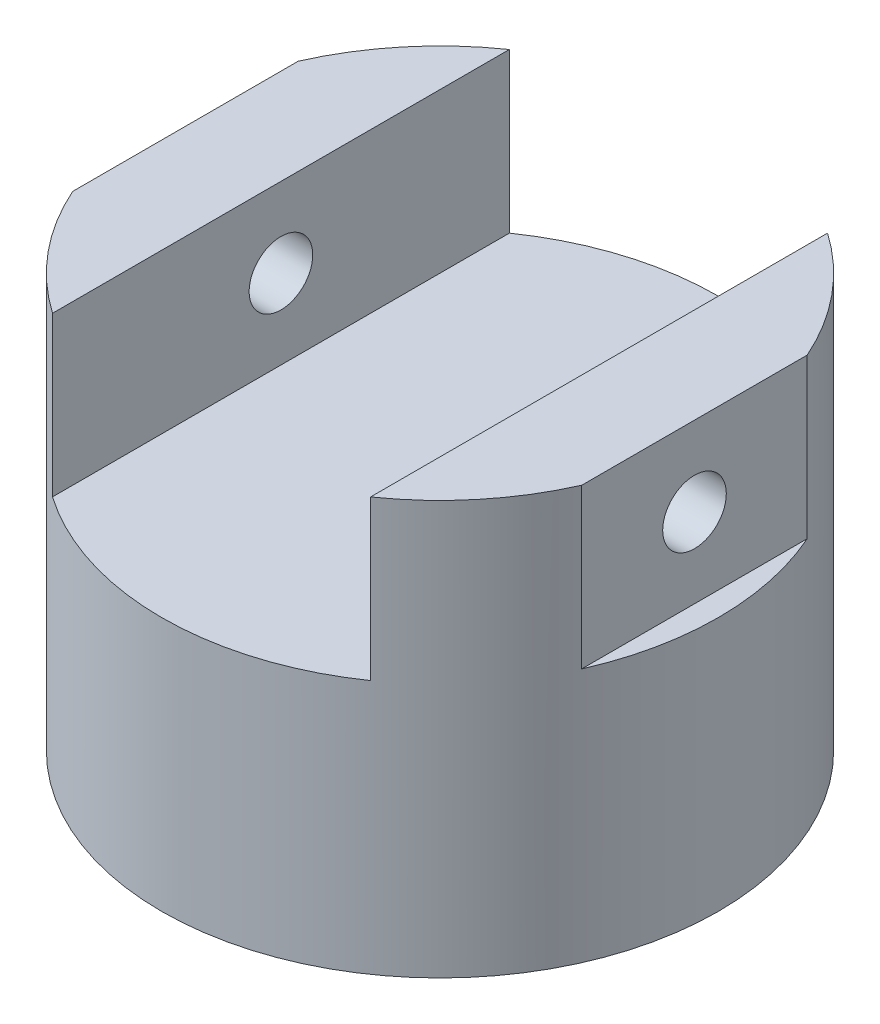
ISO-10303-21;
HEADER;
FILE_DESCRIPTION(('STEP AP214'),'2;1');
FILE_NAME('part.step','',(''),(''),'','','');
FILE_SCHEMA(('AUTOMOTIVE_DESIGN { 1 0 10303 214 1 1 1 1 }'));
ENDSEC;
DATA;
#1=APPLICATION_CONTEXT('core data for automotive mechanical design processes');
#2=APPLICATION_PROTOCOL_DEFINITION('international standard','automotive_design',2000,#1);
#3=PRODUCT_CONTEXT('',#1,'mechanical');
#4=PRODUCT('Part','Part','',(#3));
#5=PRODUCT_RELATED_PRODUCT_CATEGORY('part','',(#4));
#6=PRODUCT_DEFINITION_FORMATION('','',#4);
#7=PRODUCT_DEFINITION_CONTEXT('part definition',#1,'design');
#8=PRODUCT_DEFINITION('design','',#6,#7);
#9=PRODUCT_DEFINITION_SHAPE('','',#8);
#10=(LENGTH_UNIT() NAMED_UNIT(*) SI_UNIT(.MILLI.,.METRE.));
#11=(NAMED_UNIT(*) PLANE_ANGLE_UNIT() SI_UNIT($,.RADIAN.));
#12=(NAMED_UNIT(*) SI_UNIT($,.STERADIAN.) SOLID_ANGLE_UNIT());
#13=UNCERTAINTY_MEASURE_WITH_UNIT(LENGTH_MEASURE(1.E-05),#10,'distance_accuracy_value','');
#14=(GEOMETRIC_REPRESENTATION_CONTEXT(3) GLOBAL_UNCERTAINTY_ASSIGNED_CONTEXT((#13)) GLOBAL_UNIT_ASSIGNED_CONTEXT((#10,
#11,#12)) REPRESENTATION_CONTEXT('',''));
#15=CARTESIAN_POINT('',(0.,0.,0.));
#16=DIRECTION('',(0.,0.,1.));
#17=DIRECTION('',(1.,0.,0.));
#18=AXIS2_PLACEMENT_3D('',#15,#16,#17);
#19=CARTESIAN_POINT('',(0.,260.,0.));
#20=DIRECTION('',(0.,1.,0.));
#21=DIRECTION('',(0.,0.,1.));
#22=AXIS2_PLACEMENT_3D('',#19,#20,#21);
#23=PLANE('',#22);
#24=DIRECTION('',(0.,0.,1.));
#25=VECTOR('',#24,1.);
#26=CARTESIAN_POINT('',(160.,260.,-175.));
#27=LINE('',#26,#25);
#28=CARTESIAN_POINT('',(160.,260.,-70.887234393789));
#29=VERTEX_POINT('',#28);
#30=CARTESIAN_POINT('',(160.,260.,70.887234393789));
#31=VERTEX_POINT('',#30);
#32=EDGE_CURVE('E49',#29,#31,#27,.T.);
#33=ORIENTED_EDGE('',*,*,#32,.F.);
#34=CARTESIAN_POINT('',(0.,260.,0.));
#35=DIRECTION('',(0.,-1.,0.));
#36=DIRECTION('',(0.,0.,-1.));
#37=AXIS2_PLACEMENT_3D('',#34,#35,#36);
#38=CIRCLE('',#37,175.);
#39=CARTESIAN_POINT('',(100.,260.,-143.614066163451));
#40=VERTEX_POINT('',#39);
#41=EDGE_CURVE('E146',#40,#29,#38,.T.);
#42=ORIENTED_EDGE('',*,*,#41,.F.);
#43=DIRECTION('',(0.,0.,1.));
#44=VECTOR('',#43,1.);
#45=CARTESIAN_POINT('',(100.,260.,-175.));
#46=LINE('',#45,#44);
#47=CARTESIAN_POINT('',(100.,260.,143.614066163451));
#48=VERTEX_POINT('',#47);
#49=EDGE_CURVE('E129',#40,#48,#46,.T.);
#50=ORIENTED_EDGE('',*,*,#49,.T.);
#51=EDGE_CURVE('E145',#31,#48,#38,.T.);
#52=ORIENTED_EDGE('',*,*,#51,.F.);
#53=EDGE_LOOP('',(#33,#42,#50,#52));
#54=FACE_BOUND('',#53,.T.);
#55=ADVANCED_FACE('F33',(#54),#23,.T.);
#56=DIRECTION('',(0.,0.,1.));
#57=VECTOR('',#56,1.);
#58=CARTESIAN_POINT('',(-160.,260.,-175.));
#59=LINE('',#58,#57);
#60=CARTESIAN_POINT('',(-160.,260.,-70.887234393789));
#61=VERTEX_POINT('',#60);
#62=CARTESIAN_POINT('',(-160.,260.,70.887234393789));
#63=VERTEX_POINT('',#62);
#64=EDGE_CURVE('E115',#61,#63,#59,.T.);
#65=ORIENTED_EDGE('',*,*,#64,.T.);
#66=CARTESIAN_POINT('',(-100.,260.,143.614066163451));
#67=VERTEX_POINT('',#66);
#68=EDGE_CURVE('E143',#67,#63,#38,.T.);
#69=ORIENTED_EDGE('',*,*,#68,.F.);
#70=DIRECTION('',(0.,0.,1.));
#71=VECTOR('',#70,1.);
#72=CARTESIAN_POINT('',(-100.,260.,-175.));
#73=LINE('',#72,#71);
#74=CARTESIAN_POINT('',(-100.,260.,-143.614066163451));
#75=VERTEX_POINT('',#74);
#76=EDGE_CURVE('E57',#75,#67,#73,.T.);
#77=ORIENTED_EDGE('',*,*,#76,.F.);
#78=EDGE_CURVE('E142',#61,#75,#38,.T.);
#79=ORIENTED_EDGE('',*,*,#78,.F.);
#80=EDGE_LOOP('',(#65,#69,#77,#79));
#81=FACE_BOUND('',#80,.T.);
#82=ADVANCED_FACE('F35',(#81),#23,.T.);
#83=CARTESIAN_POINT('',(0.,0.,0.));
#84=DIRECTION('',(0.,-1.,0.));
#85=DIRECTION('',(0.,0.,-1.));
#86=AXIS2_PLACEMENT_3D('',#83,#84,#85);
#87=CYLINDRICAL_SURFACE('',#86,175.);
#88=DIRECTION('',(0.,-1.,0.));
#89=VECTOR('',#88,1.);
#90=CARTESIAN_POINT('',(-160.,0.,70.887234393789));
#91=LINE('',#90,#89);
#92=CARTESIAN_POINT('',(-160.,160.,70.8872343937891));
#93=VERTEX_POINT('',#92);
#94=EDGE_CURVE('E11',#93,#63,#91,.F.);
#95=ORIENTED_EDGE('',*,*,#94,.F.);
#96=CARTESIAN_POINT('',(0.,160.,0.));
#97=DIRECTION('',(0.,-1.,0.));
#98=DIRECTION('',(0.,0.,-1.));
#99=AXIS2_PLACEMENT_3D('',#96,#97,#98);
#100=CIRCLE('',#99,175.);
#101=CARTESIAN_POINT('',(-160.,160.,-70.8872343937891));
#102=VERTEX_POINT('',#101);
#103=EDGE_CURVE('E100',#102,#93,#100,.F.);
#104=ORIENTED_EDGE('',*,*,#103,.F.);
#105=DIRECTION('',(0.,-1.,0.));
#106=VECTOR('',#105,1.);
#107=CARTESIAN_POINT('',(-160.,0.,-70.887234393789));
#108=LINE('',#107,#106);
#109=EDGE_CURVE('E42',#61,#102,#108,.T.);
#110=ORIENTED_EDGE('',*,*,#109,.F.);
#111=ORIENTED_EDGE('',*,*,#78,.T.);
#112=DIRECTION('',(0.,-1.,0.));
#113=VECTOR('',#112,1.);
#114=CARTESIAN_POINT('',(-100.,0.,-143.614066163451));
#115=LINE('',#114,#113);
#116=CARTESIAN_POINT('',(-100.,160.,-143.614066163451));
#117=VERTEX_POINT('',#116);
#118=EDGE_CURVE('E157',#117,#75,#115,.F.);
#119=ORIENTED_EDGE('',*,*,#118,.F.);
#120=CARTESIAN_POINT('',(0.,160.,0.));
#121=DIRECTION('',(0.,-1.,0.));
#122=DIRECTION('',(0.,0.,-1.));
#123=AXIS2_PLACEMENT_3D('',#120,#121,#122);
#124=CIRCLE('',#123,175.);
#125=CARTESIAN_POINT('',(100.,160.,-143.614066163451));
#126=VERTEX_POINT('',#125);
#127=EDGE_CURVE('E150',#126,#117,#124,.F.);
#128=ORIENTED_EDGE('',*,*,#127,.F.);
#129=DIRECTION('',(0.,-1.,0.));
#130=VECTOR('',#129,1.);
#131=CARTESIAN_POINT('',(100.,0.,-143.614066163451));
#132=LINE('',#131,#130);
#133=EDGE_CURVE('E153',#40,#126,#132,.T.);
#134=ORIENTED_EDGE('',*,*,#133,.F.);
#135=ORIENTED_EDGE('',*,*,#41,.T.);
#136=DIRECTION('',(0.,-1.,0.));
#137=VECTOR('',#136,1.);
#138=CARTESIAN_POINT('',(160.,0.,-70.887234393789));
#139=LINE('',#138,#137);
#140=CARTESIAN_POINT('',(160.,160.,-70.887234393789));
#141=VERTEX_POINT('',#140);
#142=EDGE_CURVE('E109',#141,#29,#139,.F.);
#143=ORIENTED_EDGE('',*,*,#142,.F.);
#144=CARTESIAN_POINT('',(0.,160.,0.));
#145=DIRECTION('',(0.,-1.,0.));
#146=DIRECTION('',(0.,0.,-1.));
#147=AXIS2_PLACEMENT_3D('',#144,#145,#146);
#148=CIRCLE('',#147,175.);
#149=CARTESIAN_POINT('',(160.,160.,70.887234393789));
#150=VERTEX_POINT('',#149);
#151=EDGE_CURVE('E161',#150,#141,#148,.F.);
#152=ORIENTED_EDGE('',*,*,#151,.F.);
#153=DIRECTION('',(0.,-1.,0.));
#154=VECTOR('',#153,1.);
#155=CARTESIAN_POINT('',(160.,0.,70.887234393789));
#156=LINE('',#155,#154);
#157=EDGE_CURVE('E159',#31,#150,#156,.T.);
#158=ORIENTED_EDGE('',*,*,#157,.F.);
#159=ORIENTED_EDGE('',*,*,#51,.T.);
#160=DIRECTION('',(0.,-1.,0.));
#161=VECTOR('',#160,1.);
#162=CARTESIAN_POINT('',(100.,0.,143.614066163451));
#163=LINE('',#162,#161);
#164=CARTESIAN_POINT('',(100.,160.,143.614066163451));
#165=VERTEX_POINT('',#164);
#166=EDGE_CURVE('E149',#165,#48,#163,.F.);
#167=ORIENTED_EDGE('',*,*,#166,.F.);
#168=CARTESIAN_POINT('',(-100.,160.,143.614066163451));
#169=VERTEX_POINT('',#168);
#170=EDGE_CURVE('E147',#169,#165,#124,.F.);
#171=ORIENTED_EDGE('',*,*,#170,.F.);
#172=DIRECTION('',(0.,-1.,0.));
#173=VECTOR('',#172,1.);
#174=CARTESIAN_POINT('',(-100.,0.,143.614066163451));
#175=LINE('',#174,#173);
#176=EDGE_CURVE('E155',#67,#169,#175,.T.);
#177=ORIENTED_EDGE('',*,*,#176,.F.);
#178=ORIENTED_EDGE('',*,*,#68,.T.);
#179=EDGE_LOOP('',(#95,#104,#110,#111,#119,#128,#134,#135,#143,#152,#158,#159,#167,#171,#177,#178));
#180=FACE_BOUND('',#179,.T.);
#181=CARTESIAN_POINT('',(0.,0.,0.));
#182=DIRECTION('',(0.,-1.,0.));
#183=DIRECTION('',(0.,0.,-1.));
#184=AXIS2_PLACEMENT_3D('',#181,#182,#183);
#185=CIRCLE('',#184,175.);
#186=CARTESIAN_POINT('',(0.,0.,-175.));
#187=VERTEX_POINT('',#186);
#188=EDGE_CURVE('E132',#187,#187,#185,.T.);
#189=ORIENTED_EDGE('',*,*,#188,.F.);
#190=EDGE_LOOP('',(#189));
#191=FACE_BOUND('',#190,.T.);
#192=ADVANCED_FACE('F102',(#180,#191),#87,.T.);
#193=CARTESIAN_POINT('',(175.,0.,0.));
#194=DIRECTION('',(0.,-1.,0.));
#195=DIRECTION('',(0.,0.,-1.));
#196=AXIS2_PLACEMENT_3D('',#193,#194,#195);
#197=PLANE('',#196);
#198=ORIENTED_EDGE('',*,*,#188,.T.);
#199=EDGE_LOOP('',(#198));
#200=FACE_BOUND('',#199,.T.);
#201=ADVANCED_FACE('F185',(#200),#197,.T.);
#202=CARTESIAN_POINT('',(100.,260.,-175.));
#203=DIRECTION('',(1.,0.,0.));
#204=DIRECTION('',(0.,1.,0.));
#205=AXIS2_PLACEMENT_3D('',#202,#203,#204);
#206=PLANE('',#205);
#207=CARTESIAN_POINT('',(100.,210.,0.));
#208=DIRECTION('',(1.,0.,0.));
#209=DIRECTION('',(0.,1.,0.));
#210=AXIS2_PLACEMENT_3D('',#207,#208,#209);
#211=CIRCLE('',#210,20.);
#212=CARTESIAN_POINT('',(100.,230.,0.));
#213=VERTEX_POINT('',#212);
#214=EDGE_CURVE('E118',#213,#213,#211,.T.);
#215=ORIENTED_EDGE('',*,*,#214,.T.);
#216=EDGE_LOOP('',(#215));
#217=FACE_BOUND('',#216,.T.);
#218=ORIENTED_EDGE('',*,*,#166,.T.);
#219=ORIENTED_EDGE('',*,*,#49,.F.);
#220=ORIENTED_EDGE('',*,*,#133,.T.);
#221=DIRECTION('',(0.,0.,1.));
#222=VECTOR('',#221,1.);
#223=CARTESIAN_POINT('',(100.,160.,-175.));
#224=LINE('',#223,#222);
#225=EDGE_CURVE('E133',#126,#165,#224,.T.);
#226=ORIENTED_EDGE('',*,*,#225,.T.);
#227=EDGE_LOOP('',(#218,#219,#220,#226));
#228=FACE_BOUND('',#227,.T.);
#229=ADVANCED_FACE('F183',(#217,#228),#206,.F.);
#230=CARTESIAN_POINT('',(100.,160.,-175.));
#231=DIRECTION('',(0.,-1.,0.));
#232=DIRECTION('',(0.,0.,-1.));
#233=AXIS2_PLACEMENT_3D('',#230,#231,#232);
#234=PLANE('',#233);
#235=DIRECTION('',(0.,0.,1.));
#236=VECTOR('',#235,1.);
#237=CARTESIAN_POINT('',(-100.,160.,-175.));
#238=LINE('',#237,#236);
#239=EDGE_CURVE('E136',#117,#169,#238,.T.);
#240=ORIENTED_EDGE('',*,*,#239,.T.);
#241=ORIENTED_EDGE('',*,*,#170,.T.);
#242=ORIENTED_EDGE('',*,*,#225,.F.);
#243=ORIENTED_EDGE('',*,*,#127,.T.);
#244=EDGE_LOOP('',(#240,#241,#242,#243));
#245=FACE_BOUND('',#244,.T.);
#246=ADVANCED_FACE('F180',(#245),#234,.F.);
#247=CARTESIAN_POINT('',(-100.,260.,-175.));
#248=DIRECTION('',(-1.,0.,0.));
#249=DIRECTION('',(0.,-1.,0.));
#250=AXIS2_PLACEMENT_3D('',#247,#248,#249);
#251=PLANE('',#250);
#252=CARTESIAN_POINT('',(-100.,210.,0.));
#253=DIRECTION('',(-1.,0.,0.));
#254=DIRECTION('',(0.,-1.,0.));
#255=AXIS2_PLACEMENT_3D('',#252,#253,#254);
#256=CIRCLE('',#255,20.);
#257=CARTESIAN_POINT('',(-100.,190.,0.));
#258=VERTEX_POINT('',#257);
#259=EDGE_CURVE('E122',#258,#258,#256,.T.);
#260=ORIENTED_EDGE('',*,*,#259,.T.);
#261=EDGE_LOOP('',(#260));
#262=FACE_BOUND('',#261,.T.);
#263=ORIENTED_EDGE('',*,*,#118,.T.);
#264=ORIENTED_EDGE('',*,*,#76,.T.);
#265=ORIENTED_EDGE('',*,*,#176,.T.);
#266=ORIENTED_EDGE('',*,*,#239,.F.);
#267=EDGE_LOOP('',(#263,#264,#265,#266));
#268=FACE_BOUND('',#267,.T.);
#269=ADVANCED_FACE('F177',(#262,#268),#251,.F.);
#270=CARTESIAN_POINT('',(160.,160.,-175.));
#271=DIRECTION('',(0.,-1.,0.));
#272=DIRECTION('',(0.,0.,-1.));
#273=AXIS2_PLACEMENT_3D('',#270,#271,#272);
#274=PLANE('',#273);
#275=ORIENTED_EDGE('',*,*,#151,.T.);
#276=DIRECTION('',(0.,0.,1.));
#277=VECTOR('',#276,1.);
#278=CARTESIAN_POINT('',(160.,160.,-175.));
#279=LINE('',#278,#277);
#280=EDGE_CURVE('E125',#141,#150,#279,.T.);
#281=ORIENTED_EDGE('',*,*,#280,.T.);
#282=EDGE_LOOP('',(#275,#281));
#283=FACE_BOUND('',#282,.T.);
#284=ADVANCED_FACE('F207',(#283),#274,.F.);
#285=CARTESIAN_POINT('',(160.,260.,-175.));
#286=DIRECTION('',(-1.,0.,0.));
#287=DIRECTION('',(0.,-1.,0.));
#288=AXIS2_PLACEMENT_3D('',#285,#286,#287);
#289=PLANE('',#288);
#290=CARTESIAN_POINT('',(160.,210.,0.));
#291=DIRECTION('',(-1.,0.,0.));
#292=DIRECTION('',(0.,-1.,0.));
#293=AXIS2_PLACEMENT_3D('',#290,#291,#292);
#294=CIRCLE('',#293,20.);
#295=CARTESIAN_POINT('',(160.,190.,0.));
#296=VERTEX_POINT('',#295);
#297=EDGE_CURVE('E217',#296,#296,#294,.T.);
#298=ORIENTED_EDGE('',*,*,#297,.T.);
#299=EDGE_LOOP('',(#298));
#300=FACE_BOUND('',#299,.T.);
#301=ORIENTED_EDGE('',*,*,#142,.T.);
#302=ORIENTED_EDGE('',*,*,#32,.T.);
#303=ORIENTED_EDGE('',*,*,#157,.T.);
#304=ORIENTED_EDGE('',*,*,#280,.F.);
#305=EDGE_LOOP('',(#301,#302,#303,#304));
#306=FACE_BOUND('',#305,.T.);
#307=ADVANCED_FACE('F165',(#300,#306),#289,.F.);
#308=CARTESIAN_POINT('',(-160.,260.,-175.));
#309=DIRECTION('',(1.,0.,0.));
#310=DIRECTION('',(0.,1.,0.));
#311=AXIS2_PLACEMENT_3D('',#308,#309,#310);
#312=PLANE('',#311);
#313=CARTESIAN_POINT('',(-160.,210.,0.));
#314=DIRECTION('',(1.,0.,0.));
#315=DIRECTION('',(0.,1.,0.));
#316=AXIS2_PLACEMENT_3D('',#313,#314,#315);
#317=CIRCLE('',#316,20.);
#318=CARTESIAN_POINT('',(-160.,230.,0.));
#319=VERTEX_POINT('',#318);
#320=EDGE_CURVE('E37',#319,#319,#317,.T.);
#321=ORIENTED_EDGE('',*,*,#320,.T.);
#322=EDGE_LOOP('',(#321));
#323=FACE_BOUND('',#322,.T.);
#324=ORIENTED_EDGE('',*,*,#94,.T.);
#325=ORIENTED_EDGE('',*,*,#64,.F.);
#326=ORIENTED_EDGE('',*,*,#109,.T.);
#327=DIRECTION('',(0.,0.,1.));
#328=VECTOR('',#327,1.);
#329=CARTESIAN_POINT('',(-160.,160.,-175.));
#330=LINE('',#329,#328);
#331=EDGE_CURVE('E113',#102,#93,#330,.T.);
#332=ORIENTED_EDGE('',*,*,#331,.T.);
#333=EDGE_LOOP('',(#324,#325,#326,#332));
#334=FACE_BOUND('',#333,.T.);
#335=ADVANCED_FACE('F112',(#323,#334),#312,.F.);
#336=CARTESIAN_POINT('',(-160.,160.,-175.));
#337=DIRECTION('',(0.,-1.,0.));
#338=DIRECTION('',(0.,0.,-1.));
#339=AXIS2_PLACEMENT_3D('',#336,#337,#338);
#340=PLANE('',#339);
#341=ORIENTED_EDGE('',*,*,#331,.F.);
#342=ORIENTED_EDGE('',*,*,#103,.T.);
#343=EDGE_LOOP('',(#341,#342));
#344=FACE_BOUND('',#343,.T.);
#345=ADVANCED_FACE('F117',(#344),#340,.F.);
#346=CARTESIAN_POINT('',(-175.,210.,0.));
#347=DIRECTION('',(1.,0.,0.));
#348=DIRECTION('',(0.,1.,0.));
#349=AXIS2_PLACEMENT_3D('',#346,#347,#348);
#350=CYLINDRICAL_SURFACE('',#349,20.);
#351=ORIENTED_EDGE('',*,*,#320,.F.);
#352=EDGE_LOOP('',(#351));
#353=FACE_BOUND('',#352,.T.);
#354=ORIENTED_EDGE('',*,*,#259,.F.);
#355=EDGE_LOOP('',(#354));
#356=FACE_BOUND('',#355,.T.);
#357=ADVANCED_FACE('F227',(#353,#356),#350,.F.);
#358=ORIENTED_EDGE('',*,*,#297,.F.);
#359=EDGE_LOOP('',(#358));
#360=FACE_BOUND('',#359,.T.);
#361=ORIENTED_EDGE('',*,*,#214,.F.);
#362=EDGE_LOOP('',(#361));
#363=FACE_BOUND('',#362,.T.);
#364=ADVANCED_FACE('F229',(#360,#363),#350,.F.);
#365=CLOSED_SHELL('',(#55,#82,#192,#201,#229,#246,#269,#284,#307,#335,#345,#357,#364));
#366=MANIFOLD_SOLID_BREP('B2',#365);
#367=ADVANCED_BREP_SHAPE_REPRESENTATION('',(#18,#366),#14);
#368=SHAPE_DEFINITION_REPRESENTATION(#9,#367);
ENDSEC;
END-ISO-10303-21;
